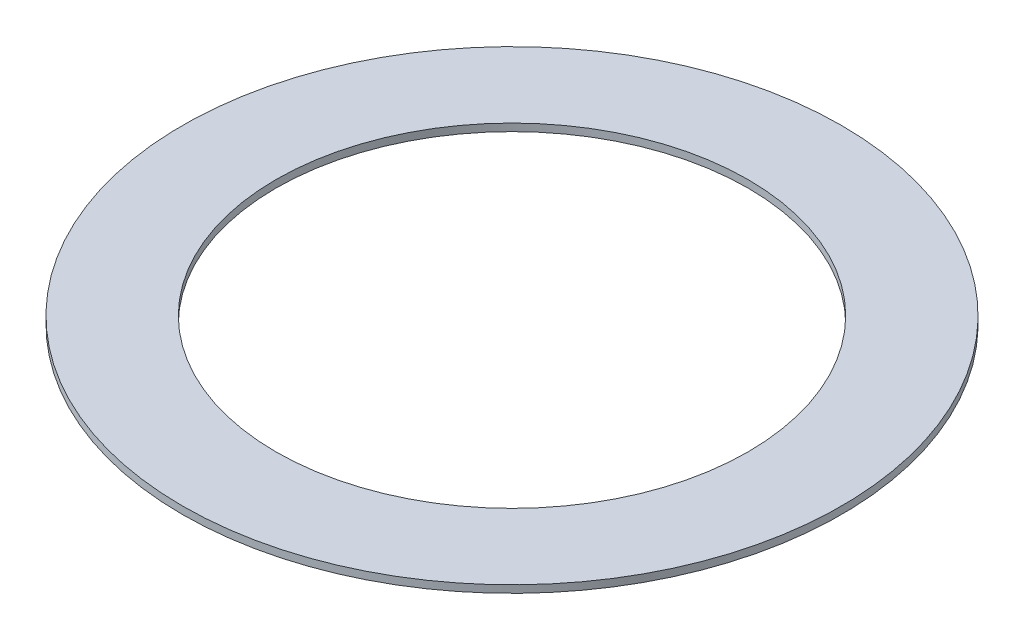
ISO-10303-21;
HEADER;
FILE_DESCRIPTION(('STEP AP214'),'2;1');
FILE_NAME('part.step','',(''),(''),'','','');
FILE_SCHEMA(('AUTOMOTIVE_DESIGN { 1 0 10303 214 1 1 1 1 }'));
ENDSEC;
DATA;
#1=APPLICATION_CONTEXT('core data for automotive mechanical design processes');
#2=APPLICATION_PROTOCOL_DEFINITION('international standard','automotive_design',2000,#1);
#3=PRODUCT_CONTEXT('',#1,'mechanical');
#4=PRODUCT('Part','Part','',(#3));
#5=PRODUCT_RELATED_PRODUCT_CATEGORY('part','',(#4));
#6=PRODUCT_DEFINITION_FORMATION('','',#4);
#7=PRODUCT_DEFINITION_CONTEXT('part definition',#1,'design');
#8=PRODUCT_DEFINITION('design','',#6,#7);
#9=PRODUCT_DEFINITION_SHAPE('','',#8);
#10=(LENGTH_UNIT() NAMED_UNIT(*) SI_UNIT(.MILLI.,.METRE.));
#11=(NAMED_UNIT(*) PLANE_ANGLE_UNIT() SI_UNIT($,.RADIAN.));
#12=(NAMED_UNIT(*) SI_UNIT($,.STERADIAN.) SOLID_ANGLE_UNIT());
#13=UNCERTAINTY_MEASURE_WITH_UNIT(LENGTH_MEASURE(1.E-05),#10,'distance_accuracy_value','');
#14=(GEOMETRIC_REPRESENTATION_CONTEXT(3) GLOBAL_UNCERTAINTY_ASSIGNED_CONTEXT((#13)) GLOBAL_UNIT_ASSIGNED_CONTEXT((#10,
#11,#12)) REPRESENTATION_CONTEXT('',''));
#15=CARTESIAN_POINT('',(0.,0.,0.));
#16=DIRECTION('',(0.,0.,1.));
#17=DIRECTION('',(1.,0.,0.));
#18=AXIS2_PLACEMENT_3D('',#15,#16,#17);
#19=CARTESIAN_POINT('',(0.,2.4,0.));
#20=DIRECTION('',(0.,1.,0.));
#21=DIRECTION('',(0.,0.,1.));
#22=AXIS2_PLACEMENT_3D('',#19,#20,#21);
#23=PLANE('',#22);
#24=CARTESIAN_POINT('',(0.,2.4,0.));
#25=DIRECTION('',(0.,1.,0.));
#26=DIRECTION('',(0.,0.,1.));
#27=AXIS2_PLACEMENT_3D('',#24,#25,#26);
#28=CIRCLE('',#27,106.426);
#29=CARTESIAN_POINT('',(0.,2.4,106.426));
#30=VERTEX_POINT('',#29);
#31=EDGE_CURVE('E10',#30,#30,#28,.T.);
#32=ORIENTED_EDGE('',*,*,#31,.T.);
#33=EDGE_LOOP('',(#32));
#34=FACE_BOUND('',#33,.T.);
#35=CARTESIAN_POINT('',(0.,2.4,0.));
#36=DIRECTION('',(0.,1.,0.));
#37=DIRECTION('',(0.,0.,1.));
#38=AXIS2_PLACEMENT_3D('',#35,#36,#37);
#39=CIRCLE('',#38,76.2);
#40=CARTESIAN_POINT('',(0.,2.4,76.2));
#41=VERTEX_POINT('',#40);
#42=EDGE_CURVE('E43',#41,#41,#39,.T.);
#43=ORIENTED_EDGE('',*,*,#42,.F.);
#44=EDGE_LOOP('',(#43));
#45=FACE_BOUND('',#44,.T.);
#46=ADVANCED_FACE('F32',(#34,#45),#23,.T.);
#47=CARTESIAN_POINT('',(0.,0.,0.));
#48=DIRECTION('',(0.,1.,0.));
#49=DIRECTION('',(0.,0.,1.));
#50=AXIS2_PLACEMENT_3D('',#47,#48,#49);
#51=PLANE('',#50);
#52=CARTESIAN_POINT('',(0.,0.,0.));
#53=DIRECTION('',(0.,1.,0.));
#54=DIRECTION('',(0.,0.,1.));
#55=AXIS2_PLACEMENT_3D('',#52,#53,#54);
#56=CIRCLE('',#55,106.426);
#57=CARTESIAN_POINT('',(0.,0.,106.426));
#58=VERTEX_POINT('',#57);
#59=EDGE_CURVE('E36',#58,#58,#56,.T.);
#60=ORIENTED_EDGE('',*,*,#59,.F.);
#61=EDGE_LOOP('',(#60));
#62=FACE_BOUND('',#61,.T.);
#63=CARTESIAN_POINT('',(0.,0.,0.));
#64=DIRECTION('',(0.,1.,0.));
#65=DIRECTION('',(0.,0.,1.));
#66=AXIS2_PLACEMENT_3D('',#63,#64,#65);
#67=CIRCLE('',#66,76.2);
#68=CARTESIAN_POINT('',(0.,0.,76.2));
#69=VERTEX_POINT('',#68);
#70=EDGE_CURVE('E45',#69,#69,#67,.T.);
#71=ORIENTED_EDGE('',*,*,#70,.T.);
#72=EDGE_LOOP('',(#71));
#73=FACE_BOUND('',#72,.T.);
#74=ADVANCED_FACE('F55',(#62,#73),#51,.F.);
#75=CARTESIAN_POINT('',(0.,2.4,0.));
#76=DIRECTION('',(0.,-1.,0.));
#77=DIRECTION('',(0.,0.,-1.));
#78=AXIS2_PLACEMENT_3D('',#75,#76,#77);
#79=CYLINDRICAL_SURFACE('',#78,106.426);
#80=ORIENTED_EDGE('',*,*,#31,.F.);
#81=EDGE_LOOP('',(#80));
#82=FACE_BOUND('',#81,.T.);
#83=ORIENTED_EDGE('',*,*,#59,.T.);
#84=EDGE_LOOP('',(#83));
#85=FACE_BOUND('',#84,.T.);
#86=ADVANCED_FACE('F34',(#82,#85),#79,.T.);
#87=CARTESIAN_POINT('',(0.,2.4,0.));
#88=DIRECTION('',(0.,-1.,0.));
#89=DIRECTION('',(0.,0.,-1.));
#90=AXIS2_PLACEMENT_3D('',#87,#88,#89);
#91=CYLINDRICAL_SURFACE('',#90,76.2);
#92=ORIENTED_EDGE('',*,*,#42,.T.);
#93=EDGE_LOOP('',(#92));
#94=FACE_BOUND('',#93,.T.);
#95=ORIENTED_EDGE('',*,*,#70,.F.);
#96=EDGE_LOOP('',(#95));
#97=FACE_BOUND('',#96,.T.);
#98=ADVANCED_FACE('F51',(#94,#97),#91,.F.);
#99=CLOSED_SHELL('',(#46,#74,#86,#98));
#100=MANIFOLD_SOLID_BREP('B2',#99);
#101=ADVANCED_BREP_SHAPE_REPRESENTATION('',(#18,#100),#14);
#102=SHAPE_DEFINITION_REPRESENTATION(#9,#101);
ENDSEC;
END-ISO-10303-21;
